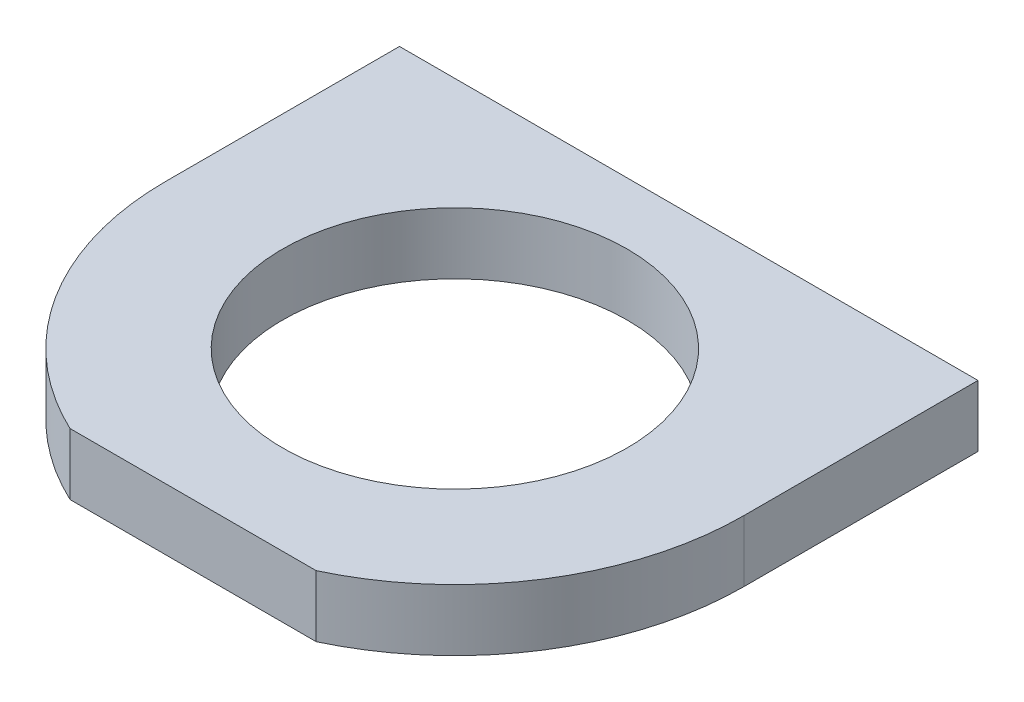
ISO-10303-21;
HEADER;
FILE_DESCRIPTION(('STEP AP214'),'2;1');
FILE_NAME('part.step','',(''),(''),'','','');
FILE_SCHEMA(('AUTOMOTIVE_DESIGN { 1 0 10303 214 1 1 1 1 }'));
ENDSEC;
DATA;
#1=APPLICATION_CONTEXT('core data for automotive mechanical design processes');
#2=APPLICATION_PROTOCOL_DEFINITION('international standard','automotive_design',2000,#1);
#3=PRODUCT_CONTEXT('',#1,'mechanical');
#4=PRODUCT('Part','Part','',(#3));
#5=PRODUCT_RELATED_PRODUCT_CATEGORY('part','',(#4));
#6=PRODUCT_DEFINITION_FORMATION('','',#4);
#7=PRODUCT_DEFINITION_CONTEXT('part definition',#1,'design');
#8=PRODUCT_DEFINITION('design','',#6,#7);
#9=PRODUCT_DEFINITION_SHAPE('','',#8);
#10=(LENGTH_UNIT() NAMED_UNIT(*) SI_UNIT(.MILLI.,.METRE.));
#11=(NAMED_UNIT(*) PLANE_ANGLE_UNIT() SI_UNIT($,.RADIAN.));
#12=(NAMED_UNIT(*) SI_UNIT($,.STERADIAN.) SOLID_ANGLE_UNIT());
#13=UNCERTAINTY_MEASURE_WITH_UNIT(LENGTH_MEASURE(1.E-05),#10,'distance_accuracy_value','');
#14=(GEOMETRIC_REPRESENTATION_CONTEXT(3) GLOBAL_UNCERTAINTY_ASSIGNED_CONTEXT((#13)) GLOBAL_UNIT_ASSIGNED_CONTEXT((#10,
#11,#12)) REPRESENTATION_CONTEXT('',''));
#15=CARTESIAN_POINT('',(0.,0.,0.));
#16=DIRECTION('',(0.,0.,1.));
#17=DIRECTION('',(1.,0.,0.));
#18=AXIS2_PLACEMENT_3D('',#15,#16,#17);
#19=CARTESIAN_POINT('',(0.,2.5,19.));
#20=DIRECTION('',(0.,-1.,0.));
#21=DIRECTION('',(0.,0.,-1.));
#22=AXIS2_PLACEMENT_3D('',#19,#20,#21);
#23=CYLINDRICAL_SURFACE('',#22,23.5);
#24=DIRECTION('',(0.,1.,0.));
#25=VECTOR('',#24,1.);
#26=CARTESIAN_POINT('',(10.,-2.5,40.2661703181367));
#27=LINE('',#26,#25);
#28=CARTESIAN_POINT('',(10.,-2.5,40.2661703181367));
#29=VERTEX_POINT('',#28);
#30=CARTESIAN_POINT('',(10.,2.5,40.2661703181367));
#31=VERTEX_POINT('',#30);
#32=EDGE_CURVE('E107',#29,#31,#27,.T.);
#33=ORIENTED_EDGE('',*,*,#32,.F.);
#34=CARTESIAN_POINT('',(0.,-2.5,19.));
#35=DIRECTION('',(0.,-1.,0.));
#36=DIRECTION('',(0.,0.,-1.));
#37=AXIS2_PLACEMENT_3D('',#34,#35,#36);
#38=CIRCLE('',#37,23.5);
#39=CARTESIAN_POINT('',(23.5,-2.5,19.));
#40=VERTEX_POINT('',#39);
#41=EDGE_CURVE('E115',#40,#29,#38,.T.);
#42=ORIENTED_EDGE('',*,*,#41,.F.);
#43=DIRECTION('',(0.,-1.,0.));
#44=VECTOR('',#43,1.);
#45=CARTESIAN_POINT('',(23.5,2.5,19.));
#46=LINE('',#45,#44);
#47=CARTESIAN_POINT('',(23.5,2.5,19.));
#48=VERTEX_POINT('',#47);
#49=EDGE_CURVE('E129',#48,#40,#46,.T.);
#50=ORIENTED_EDGE('',*,*,#49,.F.);
#51=CARTESIAN_POINT('',(0.,2.5,19.));
#52=DIRECTION('',(0.,-1.,0.));
#53=DIRECTION('',(0.,0.,-1.));
#54=AXIS2_PLACEMENT_3D('',#51,#52,#53);
#55=CIRCLE('',#54,23.5);
#56=EDGE_CURVE('E117',#48,#31,#55,.T.);
#57=ORIENTED_EDGE('',*,*,#56,.T.);
#58=EDGE_LOOP('',(#33,#42,#50,#57));
#59=FACE_BOUND('',#58,.T.);
#60=ADVANCED_FACE('F37',(#59),#23,.T.);
#61=CARTESIAN_POINT('',(-23.5,-2.5,19.));
#62=DIRECTION('',(0.,1.,0.));
#63=DIRECTION('',(0.,0.,1.));
#64=AXIS2_PLACEMENT_3D('',#61,#62,#63);
#65=PLANE('',#64);
#66=CARTESIAN_POINT('',(0.,-2.5,19.));
#67=DIRECTION('',(0.,-1.,0.));
#68=DIRECTION('',(0.,0.,-1.));
#69=AXIS2_PLACEMENT_3D('',#66,#67,#68);
#70=CIRCLE('',#69,14.);
#71=CARTESIAN_POINT('',(0.,-2.5,5.));
#72=VERTEX_POINT('',#71);
#73=EDGE_CURVE('E155',#72,#72,#70,.T.);
#74=ORIENTED_EDGE('',*,*,#73,.F.);
#75=EDGE_LOOP('',(#74));
#76=FACE_BOUND('',#75,.T.);
#77=ORIENTED_EDGE('',*,*,#41,.T.);
#78=DIRECTION('',(-1.,0.,0.));
#79=VECTOR('',#78,1.);
#80=CARTESIAN_POINT('',(-9.99999999999999,-2.5,40.2661703181367));
#81=LINE('',#80,#79);
#82=CARTESIAN_POINT('',(-9.99999999999999,-2.5,40.2661703181367));
#83=VERTEX_POINT('',#82);
#84=EDGE_CURVE('E104',#29,#83,#81,.T.);
#85=ORIENTED_EDGE('',*,*,#84,.T.);
#86=CARTESIAN_POINT('',(-23.5,-2.5,19.));
#87=VERTEX_POINT('',#86);
#88=EDGE_CURVE('E87',#83,#87,#38,.T.);
#89=ORIENTED_EDGE('',*,*,#88,.T.);
#90=DIRECTION('',(0.,0.,-1.));
#91=VECTOR('',#90,1.);
#92=CARTESIAN_POINT('',(-23.5,-2.5,19.));
#93=LINE('',#92,#91);
#94=CARTESIAN_POINT('',(-23.5,-2.5,0.));
#95=VERTEX_POINT('',#94);
#96=EDGE_CURVE('E11',#87,#95,#93,.T.);
#97=ORIENTED_EDGE('',*,*,#96,.T.);
#98=DIRECTION('',(1.,0.,0.));
#99=VECTOR('',#98,1.);
#100=CARTESIAN_POINT('',(-23.5,-2.5,0.));
#101=LINE('',#100,#99);
#102=CARTESIAN_POINT('',(23.5,-2.5,0.));
#103=VERTEX_POINT('',#102);
#104=EDGE_CURVE('E134',#95,#103,#101,.T.);
#105=ORIENTED_EDGE('',*,*,#104,.T.);
#106=DIRECTION('',(0.,0.,-1.));
#107=VECTOR('',#106,1.);
#108=CARTESIAN_POINT('',(23.5,-2.5,19.));
#109=LINE('',#108,#107);
#110=EDGE_CURVE('E45',#40,#103,#109,.T.);
#111=ORIENTED_EDGE('',*,*,#110,.F.);
#112=EDGE_LOOP('',(#77,#85,#89,#97,#105,#111));
#113=FACE_BOUND('',#112,.T.);
#114=ADVANCED_FACE('F120',(#76,#113),#65,.F.);
#115=CARTESIAN_POINT('',(-23.5,2.5,19.));
#116=DIRECTION('',(0.,1.,0.));
#117=DIRECTION('',(0.,0.,1.));
#118=AXIS2_PLACEMENT_3D('',#115,#116,#117);
#119=PLANE('',#118);
#120=DIRECTION('',(-1.,0.,0.));
#121=VECTOR('',#120,1.);
#122=CARTESIAN_POINT('',(-9.99999999999999,2.5,40.2661703181367));
#123=LINE('',#122,#121);
#124=CARTESIAN_POINT('',(-9.99999999999999,2.5,40.2661703181367));
#125=VERTEX_POINT('',#124);
#126=EDGE_CURVE('E52',#31,#125,#123,.T.);
#127=ORIENTED_EDGE('',*,*,#126,.F.);
#128=ORIENTED_EDGE('',*,*,#56,.F.);
#129=DIRECTION('',(0.,0.,-1.));
#130=VECTOR('',#129,1.);
#131=CARTESIAN_POINT('',(23.5,2.5,19.));
#132=LINE('',#131,#130);
#133=CARTESIAN_POINT('',(23.5,2.5,0.));
#134=VERTEX_POINT('',#133);
#135=EDGE_CURVE('E141',#48,#134,#132,.T.);
#136=ORIENTED_EDGE('',*,*,#135,.T.);
#137=DIRECTION('',(1.,0.,0.));
#138=VECTOR('',#137,1.);
#139=CARTESIAN_POINT('',(-23.5,2.5,0.));
#140=LINE('',#139,#138);
#141=CARTESIAN_POINT('',(-23.5,2.5,0.));
#142=VERTEX_POINT('',#141);
#143=EDGE_CURVE('E130',#142,#134,#140,.T.);
#144=ORIENTED_EDGE('',*,*,#143,.F.);
#145=DIRECTION('',(0.,0.,-1.));
#146=VECTOR('',#145,1.);
#147=CARTESIAN_POINT('',(-23.5,2.5,19.));
#148=LINE('',#147,#146);
#149=CARTESIAN_POINT('',(-23.5,2.5,19.));
#150=VERTEX_POINT('',#149);
#151=EDGE_CURVE('E81',#150,#142,#148,.T.);
#152=ORIENTED_EDGE('',*,*,#151,.F.);
#153=EDGE_CURVE('E60',#125,#150,#55,.T.);
#154=ORIENTED_EDGE('',*,*,#153,.F.);
#155=EDGE_LOOP('',(#127,#128,#136,#144,#152,#154));
#156=FACE_BOUND('',#155,.T.);
#157=CARTESIAN_POINT('',(0.,2.5,19.));
#158=DIRECTION('',(0.,-1.,0.));
#159=DIRECTION('',(0.,0.,-1.));
#160=AXIS2_PLACEMENT_3D('',#157,#158,#159);
#161=CIRCLE('',#160,14.);
#162=CARTESIAN_POINT('',(0.,2.5,5.));
#163=VERTEX_POINT('',#162);
#164=EDGE_CURVE('E157',#163,#163,#161,.T.);
#165=ORIENTED_EDGE('',*,*,#164,.T.);
#166=EDGE_LOOP('',(#165));
#167=FACE_BOUND('',#166,.T.);
#168=ADVANCED_FACE('F151',(#156,#167),#119,.T.);
#169=CARTESIAN_POINT('',(-23.5,2.5,19.));
#170=DIRECTION('',(1.,0.,0.));
#171=DIRECTION('',(0.,0.,-1.));
#172=AXIS2_PLACEMENT_3D('',#169,#170,#171);
#173=PLANE('',#172);
#174=DIRECTION('',(0.,-1.,0.));
#175=VECTOR('',#174,1.);
#176=CARTESIAN_POINT('',(-23.5,2.5,0.));
#177=LINE('',#176,#175);
#178=EDGE_CURVE('E132',#142,#95,#177,.T.);
#179=ORIENTED_EDGE('',*,*,#178,.T.);
#180=ORIENTED_EDGE('',*,*,#96,.F.);
#181=DIRECTION('',(0.,-1.,0.));
#182=VECTOR('',#181,1.);
#183=CARTESIAN_POINT('',(-23.5,2.5,19.));
#184=LINE('',#183,#182);
#185=EDGE_CURVE('E127',#150,#87,#184,.T.);
#186=ORIENTED_EDGE('',*,*,#185,.F.);
#187=ORIENTED_EDGE('',*,*,#151,.T.);
#188=EDGE_LOOP('',(#179,#180,#186,#187));
#189=FACE_BOUND('',#188,.T.);
#190=ADVANCED_FACE('F39',(#189),#173,.F.);
#191=CARTESIAN_POINT('',(23.5,2.5,19.));
#192=DIRECTION('',(1.,0.,0.));
#193=DIRECTION('',(0.,0.,-1.));
#194=AXIS2_PLACEMENT_3D('',#191,#192,#193);
#195=PLANE('',#194);
#196=DIRECTION('',(0.,-1.,0.));
#197=VECTOR('',#196,1.);
#198=CARTESIAN_POINT('',(23.5,2.5,0.));
#199=LINE('',#198,#197);
#200=EDGE_CURVE('E136',#134,#103,#199,.T.);
#201=ORIENTED_EDGE('',*,*,#200,.F.);
#202=ORIENTED_EDGE('',*,*,#135,.F.);
#203=ORIENTED_EDGE('',*,*,#49,.T.);
#204=ORIENTED_EDGE('',*,*,#110,.T.);
#205=EDGE_LOOP('',(#201,#202,#203,#204));
#206=FACE_BOUND('',#205,.T.);
#207=ADVANCED_FACE('F145',(#206),#195,.T.);
#208=CARTESIAN_POINT('',(0.,0.,0.));
#209=DIRECTION('',(0.,0.,1.));
#210=DIRECTION('',(1.,0.,0.));
#211=AXIS2_PLACEMENT_3D('',#208,#209,#210);
#212=PLANE('',#211);
#213=CARTESIAN_POINT('',(18.,0.,0.));
#214=DIRECTION('',(0.,0.,-1.));
#215=DIRECTION('',(-1.,0.,0.));
#216=AXIS2_PLACEMENT_3D('',#213,#214,#215);
#217=CIRCLE('',#216,1.025);
#218=CARTESIAN_POINT('',(16.975,0.,0.));
#219=VERTEX_POINT('',#218);
#220=EDGE_CURVE('E168',#219,#219,#217,.T.);
#221=ORIENTED_EDGE('',*,*,#220,.F.);
#222=EDGE_LOOP('',(#221));
#223=FACE_BOUND('',#222,.T.);
#224=ORIENTED_EDGE('',*,*,#200,.T.);
#225=ORIENTED_EDGE('',*,*,#104,.F.);
#226=ORIENTED_EDGE('',*,*,#178,.F.);
#227=ORIENTED_EDGE('',*,*,#143,.T.);
#228=EDGE_LOOP('',(#224,#225,#226,#227));
#229=FACE_BOUND('',#228,.T.);
#230=CARTESIAN_POINT('',(-18.,0.,0.));
#231=DIRECTION('',(0.,0.,-1.));
#232=DIRECTION('',(-1.,0.,0.));
#233=AXIS2_PLACEMENT_3D('',#230,#231,#232);
#234=CIRCLE('',#233,1.025);
#235=CARTESIAN_POINT('',(-19.025,0.,0.));
#236=VERTEX_POINT('',#235);
#237=EDGE_CURVE('E160',#236,#236,#234,.T.);
#238=ORIENTED_EDGE('',*,*,#237,.F.);
#239=EDGE_LOOP('',(#238));
#240=FACE_BOUND('',#239,.T.);
#241=ADVANCED_FACE('F147',(#223,#229,#240),#212,.F.);
#242=DIRECTION('',(0.,1.,0.));
#243=VECTOR('',#242,1.);
#244=CARTESIAN_POINT('',(-9.99999999999999,-2.5,40.2661703181367));
#245=LINE('',#244,#243);
#246=EDGE_CURVE('E108',#83,#125,#245,.T.);
#247=ORIENTED_EDGE('',*,*,#246,.T.);
#248=ORIENTED_EDGE('',*,*,#153,.T.);
#249=ORIENTED_EDGE('',*,*,#185,.T.);
#250=ORIENTED_EDGE('',*,*,#88,.F.);
#251=EDGE_LOOP('',(#247,#248,#249,#250));
#252=FACE_BOUND('',#251,.T.);
#253=ADVANCED_FACE('F183',(#252),#23,.T.);
#254=CARTESIAN_POINT('',(18.,0.,7.25));
#255=DIRECTION('',(0.,0.,-1.));
#256=DIRECTION('',(-1.,0.,0.));
#257=AXIS2_PLACEMENT_3D('',#254,#255,#256);
#258=CONICAL_SURFACE('',#257,1.025,1.02974425867665);
#259=CARTESIAN_POINT('',(18.,0.,7.86588213450325));
#260=VERTEX_POINT('',#259);
#261=VERTEX_LOOP('',#260);
#262=FACE_BOUND('',#261,.T.);
#263=CARTESIAN_POINT('',(18.,0.,7.25));
#264=DIRECTION('',(0.,0.,-1.));
#265=DIRECTION('',(-1.,0.,0.));
#266=AXIS2_PLACEMENT_3D('',#263,#264,#265);
#267=CIRCLE('',#266,1.025);
#268=CARTESIAN_POINT('',(16.975,0.,7.25));
#269=VERTEX_POINT('',#268);
#270=EDGE_CURVE('E124',#269,#269,#267,.T.);
#271=ORIENTED_EDGE('',*,*,#270,.T.);
#272=EDGE_LOOP('',(#271));
#273=FACE_BOUND('',#272,.T.);
#274=ADVANCED_FACE('F173',(#262,#273),#258,.F.);
#275=CARTESIAN_POINT('',(18.,0.,0.));
#276=DIRECTION('',(0.,0.,-1.));
#277=DIRECTION('',(-1.,0.,0.));
#278=AXIS2_PLACEMENT_3D('',#275,#276,#277);
#279=CYLINDRICAL_SURFACE('',#278,1.025);
#280=ORIENTED_EDGE('',*,*,#270,.F.);
#281=EDGE_LOOP('',(#280));
#282=FACE_BOUND('',#281,.T.);
#283=ORIENTED_EDGE('',*,*,#220,.T.);
#284=EDGE_LOOP('',(#283));
#285=FACE_BOUND('',#284,.T.);
#286=ADVANCED_FACE('F175',(#282,#285),#279,.F.);
#287=CARTESIAN_POINT('',(-18.,0.,7.25));
#288=DIRECTION('',(0.,0.,-1.));
#289=DIRECTION('',(-1.,0.,0.));
#290=AXIS2_PLACEMENT_3D('',#287,#288,#289);
#291=CONICAL_SURFACE('',#290,1.025,1.02974425867665);
#292=CARTESIAN_POINT('',(-18.,0.,7.86588213450325));
#293=VERTEX_POINT('',#292);
#294=VERTEX_LOOP('',#293);
#295=FACE_BOUND('',#294,.T.);
#296=CARTESIAN_POINT('',(-18.,0.,7.25));
#297=DIRECTION('',(0.,0.,-1.));
#298=DIRECTION('',(-1.,0.,0.));
#299=AXIS2_PLACEMENT_3D('',#296,#297,#298);
#300=CIRCLE('',#299,1.025);
#301=CARTESIAN_POINT('',(-19.025,0.,7.25));
#302=VERTEX_POINT('',#301);
#303=EDGE_CURVE('E165',#302,#302,#300,.T.);
#304=ORIENTED_EDGE('',*,*,#303,.T.);
#305=EDGE_LOOP('',(#304));
#306=FACE_BOUND('',#305,.T.);
#307=ADVANCED_FACE('F178',(#295,#306),#291,.F.);
#308=CARTESIAN_POINT('',(-18.,0.,0.));
#309=DIRECTION('',(0.,0.,-1.));
#310=DIRECTION('',(-1.,0.,0.));
#311=AXIS2_PLACEMENT_3D('',#308,#309,#310);
#312=CYLINDRICAL_SURFACE('',#311,1.025);
#313=ORIENTED_EDGE('',*,*,#303,.F.);
#314=EDGE_LOOP('',(#313));
#315=FACE_BOUND('',#314,.T.);
#316=ORIENTED_EDGE('',*,*,#237,.T.);
#317=EDGE_LOOP('',(#316));
#318=FACE_BOUND('',#317,.T.);
#319=ADVANCED_FACE('F203',(#315,#318),#312,.F.);
#320=CARTESIAN_POINT('',(0.,2.5,19.));
#321=DIRECTION('',(0.,-1.,0.));
#322=DIRECTION('',(0.,0.,-1.));
#323=AXIS2_PLACEMENT_3D('',#320,#321,#322);
#324=CYLINDRICAL_SURFACE('',#323,14.);
#325=ORIENTED_EDGE('',*,*,#164,.F.);
#326=EDGE_LOOP('',(#325));
#327=FACE_BOUND('',#326,.T.);
#328=ORIENTED_EDGE('',*,*,#73,.T.);
#329=EDGE_LOOP('',(#328));
#330=FACE_BOUND('',#329,.T.);
#331=ADVANCED_FACE('F207',(#327,#330),#324,.F.);
#332=CARTESIAN_POINT('',(-9.99999999999999,-2.5,40.2661703181367));
#333=DIRECTION('',(0.,0.,-1.));
#334=DIRECTION('',(-1.,0.,0.));
#335=AXIS2_PLACEMENT_3D('',#332,#333,#334);
#336=PLANE('',#335);
#337=ORIENTED_EDGE('',*,*,#126,.T.);
#338=ORIENTED_EDGE('',*,*,#246,.F.);
#339=ORIENTED_EDGE('',*,*,#84,.F.);
#340=ORIENTED_EDGE('',*,*,#32,.T.);
#341=EDGE_LOOP('',(#337,#338,#339,#340));
#342=FACE_BOUND('',#341,.T.);
#343=ADVANCED_FACE('F106',(#342),#336,.F.);
#344=CLOSED_SHELL('',(#60,#114,#168,#190,#207,#241,#253,#274,#286,#307,#319,#331,#343));
#345=MANIFOLD_SOLID_BREP('B2',#344);
#346=ADVANCED_BREP_SHAPE_REPRESENTATION('',(#18,#345),#14);
#347=SHAPE_DEFINITION_REPRESENTATION(#9,#346);
ENDSEC;
END-ISO-10303-21;
